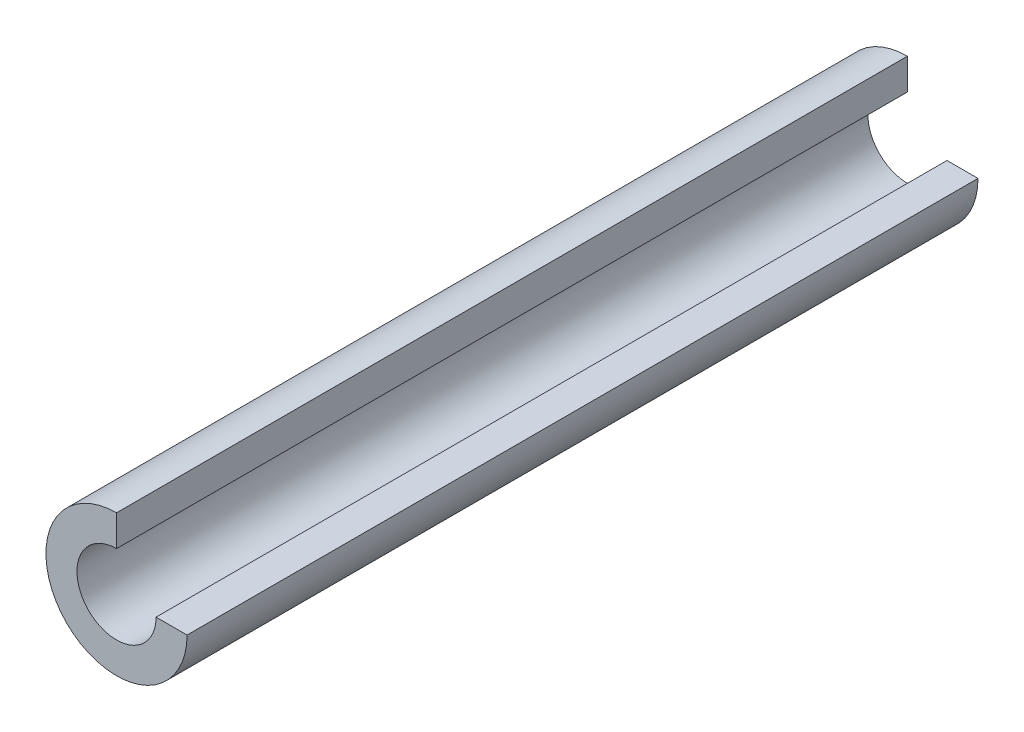
ISO-10303-21;
HEADER;
FILE_DESCRIPTION(('STEP AP214'),'2;1');
FILE_NAME('part.step','',(''),(''),'','','');
FILE_SCHEMA(('AUTOMOTIVE_DESIGN { 1 0 10303 214 1 1 1 1 }'));
ENDSEC;
DATA;
#1=APPLICATION_CONTEXT('core data for automotive mechanical design processes');
#2=APPLICATION_PROTOCOL_DEFINITION('international standard','automotive_design',2000,#1);
#3=PRODUCT_CONTEXT('',#1,'mechanical');
#4=PRODUCT('Part','Part','',(#3));
#5=PRODUCT_RELATED_PRODUCT_CATEGORY('part','',(#4));
#6=PRODUCT_DEFINITION_FORMATION('','',#4);
#7=PRODUCT_DEFINITION_CONTEXT('part definition',#1,'design');
#8=PRODUCT_DEFINITION('design','',#6,#7);
#9=PRODUCT_DEFINITION_SHAPE('','',#8);
#10=(LENGTH_UNIT() NAMED_UNIT(*) SI_UNIT(.MILLI.,.METRE.));
#11=(NAMED_UNIT(*) PLANE_ANGLE_UNIT() SI_UNIT($,.RADIAN.));
#12=(NAMED_UNIT(*) SI_UNIT($,.STERADIAN.) SOLID_ANGLE_UNIT());
#13=UNCERTAINTY_MEASURE_WITH_UNIT(LENGTH_MEASURE(1.E-05),#10,'distance_accuracy_value','');
#14=(GEOMETRIC_REPRESENTATION_CONTEXT(3) GLOBAL_UNCERTAINTY_ASSIGNED_CONTEXT((#13)) GLOBAL_UNIT_ASSIGNED_CONTEXT((#10,
#11,#12)) REPRESENTATION_CONTEXT('',''));
#15=CARTESIAN_POINT('',(0.,0.,0.));
#16=DIRECTION('',(0.,0.,1.));
#17=DIRECTION('',(1.,0.,0.));
#18=AXIS2_PLACEMENT_3D('',#15,#16,#17);
#19=CARTESIAN_POINT('',(0.,0.,40.));
#20=DIRECTION('',(0.,0.,-1.));
#21=DIRECTION('',(-1.,0.,0.));
#22=AXIS2_PLACEMENT_3D('',#19,#20,#21);
#23=CYLINDRICAL_SURFACE('',#22,2.55);
#24=CARTESIAN_POINT('',(0.,0.,0.));
#25=DIRECTION('',(0.,0.,-1.));
#26=DIRECTION('',(1.,0.,0.));
#27=AXIS2_PLACEMENT_3D('',#24,#25,#26);
#28=CIRCLE('',#27,2.55);
#29=CARTESIAN_POINT('',(2.55,0.,0.));
#30=VERTEX_POINT('',#29);
#31=CARTESIAN_POINT('',(0.,2.55,0.));
#32=VERTEX_POINT('',#31);
#33=EDGE_CURVE('E100',#30,#32,#28,.T.);
#34=ORIENTED_EDGE('',*,*,#33,.T.);
#35=DIRECTION('',(0.,0.,-1.));
#36=VECTOR('',#35,1.);
#37=CARTESIAN_POINT('',(0.,2.55,40.));
#38=LINE('',#37,#36);
#39=CARTESIAN_POINT('',(0.,2.55,51.));
#40=VERTEX_POINT('',#39);
#41=EDGE_CURVE('E12',#40,#32,#38,.T.);
#42=ORIENTED_EDGE('',*,*,#41,.F.);
#43=CARTESIAN_POINT('',(0.,0.,51.));
#44=DIRECTION('',(0.,0.,1.));
#45=DIRECTION('',(1.,0.,0.));
#46=AXIS2_PLACEMENT_3D('',#43,#44,#45);
#47=CIRCLE('',#46,2.55);
#48=CARTESIAN_POINT('',(2.55,0.,51.));
#49=VERTEX_POINT('',#48);
#50=EDGE_CURVE('E115',#49,#40,#47,.F.);
#51=ORIENTED_EDGE('',*,*,#50,.F.);
#52=DIRECTION('',(0.,0.,-1.));
#53=VECTOR('',#52,1.);
#54=CARTESIAN_POINT('',(2.55,0.,40.));
#55=LINE('',#54,#53);
#56=EDGE_CURVE('E107',#49,#30,#55,.T.);
#57=ORIENTED_EDGE('',*,*,#56,.T.);
#58=EDGE_LOOP('',(#34,#42,#51,#57));
#59=FACE_BOUND('',#58,.T.);
#60=ADVANCED_FACE('F45',(#59),#23,.F.);
#61=CARTESIAN_POINT('',(0.,2.55,40.));
#62=DIRECTION('',(-1.,0.,0.));
#63=DIRECTION('',(0.,0.,1.));
#64=AXIS2_PLACEMENT_3D('',#61,#62,#63);
#65=PLANE('',#64);
#66=DIRECTION('',(0.,1.,0.));
#67=VECTOR('',#66,1.);
#68=CARTESIAN_POINT('',(0.,2.55,0.));
#69=LINE('',#68,#67);
#70=CARTESIAN_POINT('',(0.,4.55,0.));
#71=VERTEX_POINT('',#70);
#72=EDGE_CURVE('E97',#32,#71,#69,.T.);
#73=ORIENTED_EDGE('',*,*,#72,.T.);
#74=DIRECTION('',(0.,0.,-1.));
#75=VECTOR('',#74,1.);
#76=CARTESIAN_POINT('',(0.,4.55,40.));
#77=LINE('',#76,#75);
#78=CARTESIAN_POINT('',(0.,4.55,51.));
#79=VERTEX_POINT('',#78);
#80=EDGE_CURVE('E56',#79,#71,#77,.T.);
#81=ORIENTED_EDGE('',*,*,#80,.F.);
#82=DIRECTION('',(0.,1.,0.));
#83=VECTOR('',#82,1.);
#84=CARTESIAN_POINT('',(0.,2.55,51.));
#85=LINE('',#84,#83);
#86=EDGE_CURVE('E49',#40,#79,#85,.T.);
#87=ORIENTED_EDGE('',*,*,#86,.F.);
#88=ORIENTED_EDGE('',*,*,#41,.T.);
#89=EDGE_LOOP('',(#73,#81,#87,#88));
#90=FACE_BOUND('',#89,.T.);
#91=ADVANCED_FACE('F104',(#90),#65,.F.);
#92=CARTESIAN_POINT('',(0.,0.,40.));
#93=DIRECTION('',(0.,0.,-1.));
#94=DIRECTION('',(-1.,0.,0.));
#95=AXIS2_PLACEMENT_3D('',#92,#93,#94);
#96=CYLINDRICAL_SURFACE('',#95,4.55);
#97=CARTESIAN_POINT('',(0.,0.,0.));
#98=DIRECTION('',(0.,0.,1.));
#99=DIRECTION('',(1.,0.,0.));
#100=AXIS2_PLACEMENT_3D('',#97,#98,#99);
#101=CIRCLE('',#100,4.55);
#102=CARTESIAN_POINT('',(4.55,0.,0.));
#103=VERTEX_POINT('',#102);
#104=EDGE_CURVE('E89',#71,#103,#101,.T.);
#105=ORIENTED_EDGE('',*,*,#104,.T.);
#106=DIRECTION('',(0.,0.,-1.));
#107=VECTOR('',#106,1.);
#108=CARTESIAN_POINT('',(4.55,0.,40.));
#109=LINE('',#108,#107);
#110=CARTESIAN_POINT('',(4.55,0.,51.));
#111=VERTEX_POINT('',#110);
#112=EDGE_CURVE('E118',#111,#103,#109,.T.);
#113=ORIENTED_EDGE('',*,*,#112,.F.);
#114=CARTESIAN_POINT('',(0.,0.,51.));
#115=DIRECTION('',(0.,0.,1.));
#116=DIRECTION('',(1.,0.,0.));
#117=AXIS2_PLACEMENT_3D('',#114,#115,#116);
#118=CIRCLE('',#117,4.55);
#119=EDGE_CURVE('E126',#79,#111,#118,.T.);
#120=ORIENTED_EDGE('',*,*,#119,.F.);
#121=ORIENTED_EDGE('',*,*,#80,.T.);
#122=EDGE_LOOP('',(#105,#113,#120,#121));
#123=FACE_BOUND('',#122,.T.);
#124=ADVANCED_FACE('F130',(#123),#96,.T.);
#125=CARTESIAN_POINT('',(2.55,0.,40.));
#126=DIRECTION('',(0.,-1.,0.));
#127=DIRECTION('',(0.,0.,-1.));
#128=AXIS2_PLACEMENT_3D('',#125,#126,#127);
#129=PLANE('',#128);
#130=DIRECTION('',(-1.,0.,0.));
#131=VECTOR('',#130,1.);
#132=CARTESIAN_POINT('',(2.55,0.,0.));
#133=LINE('',#132,#131);
#134=EDGE_CURVE('E81',#103,#30,#133,.T.);
#135=ORIENTED_EDGE('',*,*,#134,.T.);
#136=ORIENTED_EDGE('',*,*,#56,.F.);
#137=DIRECTION('',(-1.,0.,0.));
#138=VECTOR('',#137,1.);
#139=CARTESIAN_POINT('',(2.55,0.,51.));
#140=LINE('',#139,#138);
#141=EDGE_CURVE('E65',#111,#49,#140,.T.);
#142=ORIENTED_EDGE('',*,*,#141,.F.);
#143=ORIENTED_EDGE('',*,*,#112,.T.);
#144=EDGE_LOOP('',(#135,#136,#142,#143));
#145=FACE_BOUND('',#144,.T.);
#146=ADVANCED_FACE('F131',(#145),#129,.F.);
#147=CARTESIAN_POINT('',(0.,0.,51.));
#148=DIRECTION('',(0.,0.,1.));
#149=DIRECTION('',(1.,0.,0.));
#150=AXIS2_PLACEMENT_3D('',#147,#148,#149);
#151=PLANE('',#150);
#152=ORIENTED_EDGE('',*,*,#50,.T.);
#153=ORIENTED_EDGE('',*,*,#86,.T.);
#154=ORIENTED_EDGE('',*,*,#119,.T.);
#155=ORIENTED_EDGE('',*,*,#141,.T.);
#156=EDGE_LOOP('',(#152,#153,#154,#155));
#157=FACE_BOUND('',#156,.T.);
#158=ADVANCED_FACE('F47',(#157),#151,.T.);
#159=CARTESIAN_POINT('',(0.,0.,0.));
#160=DIRECTION('',(0.,0.,1.));
#161=DIRECTION('',(1.,0.,0.));
#162=AXIS2_PLACEMENT_3D('',#159,#160,#161);
#163=PLANE('',#162);
#164=ORIENTED_EDGE('',*,*,#33,.F.);
#165=ORIENTED_EDGE('',*,*,#134,.F.);
#166=ORIENTED_EDGE('',*,*,#104,.F.);
#167=ORIENTED_EDGE('',*,*,#72,.F.);
#168=EDGE_LOOP('',(#164,#165,#166,#167));
#169=FACE_BOUND('',#168,.T.);
#170=ADVANCED_FACE('F98',(#169),#163,.F.);
#171=CLOSED_SHELL('',(#60,#91,#124,#146,#158,#170));
#172=MANIFOLD_SOLID_BREP('B2',#171);
#173=ADVANCED_BREP_SHAPE_REPRESENTATION('',(#18,#172),#14);
#174=SHAPE_DEFINITION_REPRESENTATION(#9,#173);
ENDSEC;
END-ISO-10303-21;
